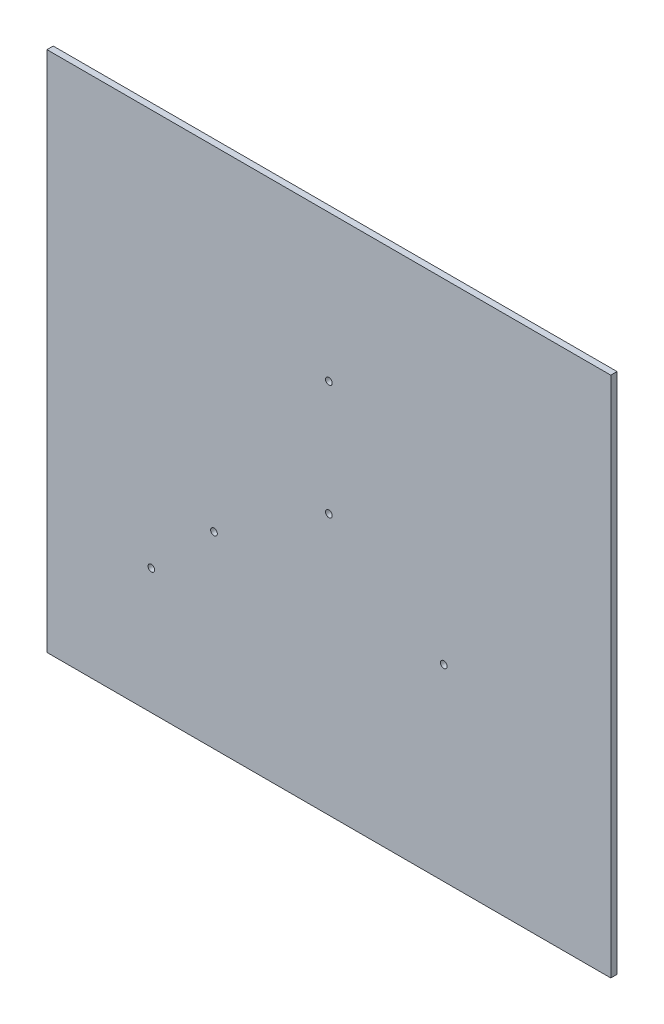
ISO-10303-21;
HEADER;
FILE_DESCRIPTION(('STEP AP214'),'2;1');
FILE_NAME('part.step','',(''),(''),'','','');
FILE_SCHEMA(('AUTOMOTIVE_DESIGN { 1 0 10303 214 1 1 1 1 }'));
ENDSEC;
DATA;
#1=APPLICATION_CONTEXT('core data for automotive mechanical design processes');
#2=APPLICATION_PROTOCOL_DEFINITION('international standard','automotive_design',2000,#1);
#3=PRODUCT_CONTEXT('',#1,'mechanical');
#4=PRODUCT('Part','Part','',(#3));
#5=PRODUCT_RELATED_PRODUCT_CATEGORY('part','',(#4));
#6=PRODUCT_DEFINITION_FORMATION('','',#4);
#7=PRODUCT_DEFINITION_CONTEXT('part definition',#1,'design');
#8=PRODUCT_DEFINITION('design','',#6,#7);
#9=PRODUCT_DEFINITION_SHAPE('','',#8);
#10=(LENGTH_UNIT() NAMED_UNIT(*) SI_UNIT(.MILLI.,.METRE.));
#11=(NAMED_UNIT(*) PLANE_ANGLE_UNIT() SI_UNIT($,.RADIAN.));
#12=(NAMED_UNIT(*) SI_UNIT($,.STERADIAN.) SOLID_ANGLE_UNIT());
#13=UNCERTAINTY_MEASURE_WITH_UNIT(LENGTH_MEASURE(1.E-05),#10,'distance_accuracy_value','');
#14=(GEOMETRIC_REPRESENTATION_CONTEXT(3) GLOBAL_UNCERTAINTY_ASSIGNED_CONTEXT((#13)) GLOBAL_UNIT_ASSIGNED_CONTEXT((#10,
#11,#12)) REPRESENTATION_CONTEXT('',''));
#15=CARTESIAN_POINT('',(0.,0.,0.));
#16=DIRECTION('',(0.,0.,1.));
#17=DIRECTION('',(1.,0.,0.));
#18=AXIS2_PLACEMENT_3D('',#15,#16,#17);
#19=CARTESIAN_POINT('',(0.,0.,3.));
#20=DIRECTION('',(0.,0.,-1.));
#21=DIRECTION('',(-1.,0.,0.));
#22=AXIS2_PLACEMENT_3D('',#19,#20,#21);
#23=PLANE('',#22);
#24=DIRECTION('',(0.,1.,0.));
#25=VECTOR('',#24,1.);
#26=CARTESIAN_POINT('',(135.,-125.,3.));
#27=LINE('',#26,#25);
#28=CARTESIAN_POINT('',(135.,-125.,3.));
#29=VERTEX_POINT('',#28);
#30=CARTESIAN_POINT('',(135.,125.,3.));
#31=VERTEX_POINT('',#30);
#32=EDGE_CURVE('E81',#29,#31,#27,.T.);
#33=ORIENTED_EDGE('',*,*,#32,.T.);
#34=DIRECTION('',(-1.,0.,0.));
#35=VECTOR('',#34,1.);
#36=CARTESIAN_POINT('',(-135.,125.,3.));
#37=LINE('',#36,#35);
#38=CARTESIAN_POINT('',(-135.,125.,3.));
#39=VERTEX_POINT('',#38);
#40=EDGE_CURVE('E76',#31,#39,#37,.T.);
#41=ORIENTED_EDGE('',*,*,#40,.T.);
#42=DIRECTION('',(0.,-1.,0.));
#43=VECTOR('',#42,1.);
#44=CARTESIAN_POINT('',(-135.,-125.,3.));
#45=LINE('',#44,#43);
#46=CARTESIAN_POINT('',(-135.,-125.,3.));
#47=VERTEX_POINT('',#46);
#48=EDGE_CURVE('E79',#39,#47,#45,.T.);
#49=ORIENTED_EDGE('',*,*,#48,.T.);
#50=DIRECTION('',(1.,0.,0.));
#51=VECTOR('',#50,1.);
#52=CARTESIAN_POINT('',(-135.,-125.,3.));
#53=LINE('',#52,#51);
#54=EDGE_CURVE('E46',#47,#29,#53,.T.);
#55=ORIENTED_EDGE('',*,*,#54,.T.);
#56=EDGE_LOOP('',(#33,#41,#49,#55));
#57=FACE_BOUND('',#56,.T.);
#58=CARTESIAN_POINT('',(-85.0000000000001,-65.,3.));
#59=DIRECTION('',(0.,0.,1.));
#60=DIRECTION('',(1.,0.,0.));
#61=AXIS2_PLACEMENT_3D('',#58,#59,#60);
#62=CIRCLE('',#61,1.60000000000001);
#63=CARTESIAN_POINT('',(-83.4000000000001,-65.,3.));
#64=VERTEX_POINT('',#63);
#65=EDGE_CURVE('E96',#64,#64,#62,.T.);
#66=ORIENTED_EDGE('',*,*,#65,.F.);
#67=EDGE_LOOP('',(#66));
#68=FACE_BOUND('',#67,.T.);
#69=CARTESIAN_POINT('',(0.,55.,3.));
#70=DIRECTION('',(0.,0.,1.));
#71=DIRECTION('',(1.,0.,0.));
#72=AXIS2_PLACEMENT_3D('',#69,#70,#71);
#73=CIRCLE('',#72,1.6);
#74=CARTESIAN_POINT('',(1.6,55.,3.));
#75=VERTEX_POINT('',#74);
#76=EDGE_CURVE('E111',#75,#75,#73,.T.);
#77=ORIENTED_EDGE('',*,*,#76,.F.);
#78=EDGE_LOOP('',(#77));
#79=FACE_BOUND('',#78,.T.);
#80=CARTESIAN_POINT('',(-55.0000000000001,-35.,3.));
#81=DIRECTION('',(0.,0.,1.));
#82=DIRECTION('',(1.,0.,0.));
#83=AXIS2_PLACEMENT_3D('',#80,#81,#82);
#84=CIRCLE('',#83,1.60000000000001);
#85=CARTESIAN_POINT('',(-53.4000000000001,-35.,3.));
#86=VERTEX_POINT('',#85);
#87=EDGE_CURVE('E117',#86,#86,#84,.T.);
#88=ORIENTED_EDGE('',*,*,#87,.F.);
#89=EDGE_LOOP('',(#88));
#90=FACE_BOUND('',#89,.T.);
#91=CARTESIAN_POINT('',(55.0000000000001,-35.,3.));
#92=DIRECTION('',(0.,0.,1.));
#93=DIRECTION('',(1.,0.,0.));
#94=AXIS2_PLACEMENT_3D('',#91,#92,#93);
#95=CIRCLE('',#94,1.60000000000001);
#96=CARTESIAN_POINT('',(56.6000000000001,-35.,3.));
#97=VERTEX_POINT('',#96);
#98=EDGE_CURVE('E123',#97,#97,#95,.T.);
#99=ORIENTED_EDGE('',*,*,#98,.F.);
#100=EDGE_LOOP('',(#99));
#101=FACE_BOUND('',#100,.T.);
#102=CARTESIAN_POINT('',(-1.38777878078145E-13,0.,3.));
#103=DIRECTION('',(0.,0.,1.));
#104=DIRECTION('',(1.,0.,0.));
#105=AXIS2_PLACEMENT_3D('',#102,#103,#104);
#106=CIRCLE('',#105,1.6);
#107=CARTESIAN_POINT('',(1.59999999999986,0.,3.));
#108=VERTEX_POINT('',#107);
#109=EDGE_CURVE('E129',#108,#108,#106,.T.);
#110=ORIENTED_EDGE('',*,*,#109,.F.);
#111=EDGE_LOOP('',(#110));
#112=FACE_BOUND('',#111,.T.);
#113=ADVANCED_FACE('F29',(#57,#68,#79,#90,#101,#112),#23,.F.);
#114=CARTESIAN_POINT('',(0.,0.,0.));
#115=DIRECTION('',(0.,0.,-1.));
#116=DIRECTION('',(-1.,0.,0.));
#117=AXIS2_PLACEMENT_3D('',#114,#115,#116);
#118=PLANE('',#117);
#119=CARTESIAN_POINT('',(55.0000000000001,-35.,0.));
#120=DIRECTION('',(0.,0.,1.));
#121=DIRECTION('',(1.,0.,0.));
#122=AXIS2_PLACEMENT_3D('',#119,#120,#121);
#123=CIRCLE('',#122,1.60000000000001);
#124=CARTESIAN_POINT('',(56.6000000000001,-35.,0.));
#125=VERTEX_POINT('',#124);
#126=EDGE_CURVE('E126',#125,#125,#123,.T.);
#127=ORIENTED_EDGE('',*,*,#126,.T.);
#128=EDGE_LOOP('',(#127));
#129=FACE_BOUND('',#128,.T.);
#130=CARTESIAN_POINT('',(0.,55.,0.));
#131=DIRECTION('',(0.,0.,1.));
#132=DIRECTION('',(1.,0.,0.));
#133=AXIS2_PLACEMENT_3D('',#130,#131,#132);
#134=CIRCLE('',#133,1.6);
#135=CARTESIAN_POINT('',(1.6,55.,0.));
#136=VERTEX_POINT('',#135);
#137=EDGE_CURVE('E114',#136,#136,#134,.T.);
#138=ORIENTED_EDGE('',*,*,#137,.T.);
#139=EDGE_LOOP('',(#138));
#140=FACE_BOUND('',#139,.T.);
#141=DIRECTION('',(0.,1.,0.));
#142=VECTOR('',#141,1.);
#143=CARTESIAN_POINT('',(135.,-125.,0.));
#144=LINE('',#143,#142);
#145=CARTESIAN_POINT('',(135.,-125.,0.));
#146=VERTEX_POINT('',#145);
#147=CARTESIAN_POINT('',(135.,125.,0.));
#148=VERTEX_POINT('',#147);
#149=EDGE_CURVE('E93',#146,#148,#144,.T.);
#150=ORIENTED_EDGE('',*,*,#149,.F.);
#151=DIRECTION('',(1.,0.,0.));
#152=VECTOR('',#151,1.);
#153=CARTESIAN_POINT('',(-135.,-125.,0.));
#154=LINE('',#153,#152);
#155=CARTESIAN_POINT('',(-135.,-125.,0.));
#156=VERTEX_POINT('',#155);
#157=EDGE_CURVE('E69',#156,#146,#154,.T.);
#158=ORIENTED_EDGE('',*,*,#157,.F.);
#159=DIRECTION('',(0.,-1.,0.));
#160=VECTOR('',#159,1.);
#161=CARTESIAN_POINT('',(-135.,-125.,0.));
#162=LINE('',#161,#160);
#163=CARTESIAN_POINT('',(-135.,125.,0.));
#164=VERTEX_POINT('',#163);
#165=EDGE_CURVE('E63',#164,#156,#162,.T.);
#166=ORIENTED_EDGE('',*,*,#165,.F.);
#167=DIRECTION('',(-1.,0.,0.));
#168=VECTOR('',#167,1.);
#169=CARTESIAN_POINT('',(-135.,125.,0.));
#170=LINE('',#169,#168);
#171=EDGE_CURVE('E85',#148,#164,#170,.T.);
#172=ORIENTED_EDGE('',*,*,#171,.F.);
#173=EDGE_LOOP('',(#150,#158,#166,#172));
#174=FACE_BOUND('',#173,.T.);
#175=CARTESIAN_POINT('',(-85.0000000000001,-65.,0.));
#176=DIRECTION('',(0.,0.,1.));
#177=DIRECTION('',(1.,0.,0.));
#178=AXIS2_PLACEMENT_3D('',#175,#176,#177);
#179=CIRCLE('',#178,1.60000000000001);
#180=CARTESIAN_POINT('',(-83.4000000000001,-65.,0.));
#181=VERTEX_POINT('',#180);
#182=EDGE_CURVE('E108',#181,#181,#179,.T.);
#183=ORIENTED_EDGE('',*,*,#182,.T.);
#184=EDGE_LOOP('',(#183));
#185=FACE_BOUND('',#184,.T.);
#186=CARTESIAN_POINT('',(-55.0000000000001,-35.,0.));
#187=DIRECTION('',(0.,0.,1.));
#188=DIRECTION('',(1.,0.,0.));
#189=AXIS2_PLACEMENT_3D('',#186,#187,#188);
#190=CIRCLE('',#189,1.60000000000001);
#191=CARTESIAN_POINT('',(-53.4000000000001,-35.,0.));
#192=VERTEX_POINT('',#191);
#193=EDGE_CURVE('E120',#192,#192,#190,.T.);
#194=ORIENTED_EDGE('',*,*,#193,.T.);
#195=EDGE_LOOP('',(#194));
#196=FACE_BOUND('',#195,.T.);
#197=CARTESIAN_POINT('',(-1.38777878078145E-13,0.,0.));
#198=DIRECTION('',(0.,0.,1.));
#199=DIRECTION('',(1.,0.,0.));
#200=AXIS2_PLACEMENT_3D('',#197,#198,#199);
#201=CIRCLE('',#200,1.6);
#202=CARTESIAN_POINT('',(1.59999999999986,0.,0.));
#203=VERTEX_POINT('',#202);
#204=EDGE_CURVE('E132',#203,#203,#201,.T.);
#205=ORIENTED_EDGE('',*,*,#204,.T.);
#206=EDGE_LOOP('',(#205));
#207=FACE_BOUND('',#206,.T.);
#208=ADVANCED_FACE('F104',(#129,#140,#174,#185,#196,#207),#118,.T.);
#209=CARTESIAN_POINT('',(135.,-125.,3.));
#210=DIRECTION('',(-1.,0.,0.));
#211=DIRECTION('',(0.,0.,1.));
#212=AXIS2_PLACEMENT_3D('',#209,#210,#211);
#213=PLANE('',#212);
#214=ORIENTED_EDGE('',*,*,#149,.T.);
#215=DIRECTION('',(0.,0.,-1.));
#216=VECTOR('',#215,1.);
#217=CARTESIAN_POINT('',(135.,125.,3.));
#218=LINE('',#217,#216);
#219=EDGE_CURVE('E11',#31,#148,#218,.T.);
#220=ORIENTED_EDGE('',*,*,#219,.F.);
#221=ORIENTED_EDGE('',*,*,#32,.F.);
#222=DIRECTION('',(0.,0.,-1.));
#223=VECTOR('',#222,1.);
#224=CARTESIAN_POINT('',(135.,-125.,3.));
#225=LINE('',#224,#223);
#226=EDGE_CURVE('E89',#29,#146,#225,.T.);
#227=ORIENTED_EDGE('',*,*,#226,.T.);
#228=EDGE_LOOP('',(#214,#220,#221,#227));
#229=FACE_BOUND('',#228,.T.);
#230=ADVANCED_FACE('F31',(#229),#213,.F.);
#231=CARTESIAN_POINT('',(-135.,125.,3.));
#232=DIRECTION('',(0.,-1.,0.));
#233=DIRECTION('',(0.,0.,-1.));
#234=AXIS2_PLACEMENT_3D('',#231,#232,#233);
#235=PLANE('',#234);
#236=ORIENTED_EDGE('',*,*,#171,.T.);
#237=DIRECTION('',(0.,0.,-1.));
#238=VECTOR('',#237,1.);
#239=CARTESIAN_POINT('',(-135.,125.,3.));
#240=LINE('',#239,#238);
#241=EDGE_CURVE('E38',#39,#164,#240,.T.);
#242=ORIENTED_EDGE('',*,*,#241,.F.);
#243=ORIENTED_EDGE('',*,*,#40,.F.);
#244=ORIENTED_EDGE('',*,*,#219,.T.);
#245=EDGE_LOOP('',(#236,#242,#243,#244));
#246=FACE_BOUND('',#245,.T.);
#247=ADVANCED_FACE('F84',(#246),#235,.F.);
#248=CARTESIAN_POINT('',(-135.,-125.,3.));
#249=DIRECTION('',(1.,0.,0.));
#250=DIRECTION('',(0.,0.,-1.));
#251=AXIS2_PLACEMENT_3D('',#248,#249,#250);
#252=PLANE('',#251);
#253=ORIENTED_EDGE('',*,*,#165,.T.);
#254=DIRECTION('',(0.,0.,-1.));
#255=VECTOR('',#254,1.);
#256=CARTESIAN_POINT('',(-135.,-125.,3.));
#257=LINE('',#256,#255);
#258=EDGE_CURVE('E86',#47,#156,#257,.T.);
#259=ORIENTED_EDGE('',*,*,#258,.F.);
#260=ORIENTED_EDGE('',*,*,#48,.F.);
#261=ORIENTED_EDGE('',*,*,#241,.T.);
#262=EDGE_LOOP('',(#253,#259,#260,#261));
#263=FACE_BOUND('',#262,.T.);
#264=ADVANCED_FACE('F87',(#263),#252,.F.);
#265=CARTESIAN_POINT('',(-135.,-125.,3.));
#266=DIRECTION('',(0.,1.,0.));
#267=DIRECTION('',(0.,0.,1.));
#268=AXIS2_PLACEMENT_3D('',#265,#266,#267);
#269=PLANE('',#268);
#270=ORIENTED_EDGE('',*,*,#157,.T.);
#271=ORIENTED_EDGE('',*,*,#226,.F.);
#272=ORIENTED_EDGE('',*,*,#54,.F.);
#273=ORIENTED_EDGE('',*,*,#258,.T.);
#274=EDGE_LOOP('',(#270,#271,#272,#273));
#275=FACE_BOUND('',#274,.T.);
#276=ADVANCED_FACE('F101',(#275),#269,.F.);
#277=CARTESIAN_POINT('',(-85.0000000000001,-65.,3.));
#278=DIRECTION('',(0.,0.,-1.));
#279=DIRECTION('',(-1.,0.,0.));
#280=AXIS2_PLACEMENT_3D('',#277,#278,#279);
#281=CYLINDRICAL_SURFACE('',#280,1.60000000000001);
#282=ORIENTED_EDGE('',*,*,#65,.T.);
#283=EDGE_LOOP('',(#282));
#284=FACE_BOUND('',#283,.T.);
#285=ORIENTED_EDGE('',*,*,#182,.F.);
#286=EDGE_LOOP('',(#285));
#287=FACE_BOUND('',#286,.T.);
#288=ADVANCED_FACE('F149',(#284,#287),#281,.F.);
#289=CARTESIAN_POINT('',(0.,55.,3.));
#290=DIRECTION('',(0.,0.,-1.));
#291=DIRECTION('',(-1.,0.,0.));
#292=AXIS2_PLACEMENT_3D('',#289,#290,#291);
#293=CYLINDRICAL_SURFACE('',#292,1.6);
#294=ORIENTED_EDGE('',*,*,#76,.T.);
#295=EDGE_LOOP('',(#294));
#296=FACE_BOUND('',#295,.T.);
#297=ORIENTED_EDGE('',*,*,#137,.F.);
#298=EDGE_LOOP('',(#297));
#299=FACE_BOUND('',#298,.T.);
#300=ADVANCED_FACE('F184',(#296,#299),#293,.F.);
#301=CARTESIAN_POINT('',(-55.0000000000001,-35.,3.));
#302=DIRECTION('',(0.,0.,-1.));
#303=DIRECTION('',(-1.,0.,0.));
#304=AXIS2_PLACEMENT_3D('',#301,#302,#303);
#305=CYLINDRICAL_SURFACE('',#304,1.60000000000001);
#306=ORIENTED_EDGE('',*,*,#87,.T.);
#307=EDGE_LOOP('',(#306));
#308=FACE_BOUND('',#307,.T.);
#309=ORIENTED_EDGE('',*,*,#193,.F.);
#310=EDGE_LOOP('',(#309));
#311=FACE_BOUND('',#310,.T.);
#312=ADVANCED_FACE('F191',(#308,#311),#305,.F.);
#313=CARTESIAN_POINT('',(55.0000000000001,-35.,3.));
#314=DIRECTION('',(0.,0.,-1.));
#315=DIRECTION('',(-1.,0.,0.));
#316=AXIS2_PLACEMENT_3D('',#313,#314,#315);
#317=CYLINDRICAL_SURFACE('',#316,1.60000000000001);
#318=ORIENTED_EDGE('',*,*,#98,.T.);
#319=EDGE_LOOP('',(#318));
#320=FACE_BOUND('',#319,.T.);
#321=ORIENTED_EDGE('',*,*,#126,.F.);
#322=EDGE_LOOP('',(#321));
#323=FACE_BOUND('',#322,.T.);
#324=ADVANCED_FACE('F198',(#320,#323),#317,.F.);
#325=CARTESIAN_POINT('',(-1.38777878078145E-13,0.,3.));
#326=DIRECTION('',(0.,0.,-1.));
#327=DIRECTION('',(-1.,0.,0.));
#328=AXIS2_PLACEMENT_3D('',#325,#326,#327);
#329=CYLINDRICAL_SURFACE('',#328,1.6);
#330=ORIENTED_EDGE('',*,*,#109,.T.);
#331=EDGE_LOOP('',(#330));
#332=FACE_BOUND('',#331,.T.);
#333=ORIENTED_EDGE('',*,*,#204,.F.);
#334=EDGE_LOOP('',(#333));
#335=FACE_BOUND('',#334,.T.);
#336=ADVANCED_FACE('F138',(#332,#335),#329,.F.);
#337=CLOSED_SHELL('',(#113,#208,#230,#247,#264,#276,#288,#300,#312,#324,#336));
#338=MANIFOLD_SOLID_BREP('B2',#337);
#339=ADVANCED_BREP_SHAPE_REPRESENTATION('',(#18,#338),#14);
#340=SHAPE_DEFINITION_REPRESENTATION(#9,#339);
ENDSEC;
END-ISO-10303-21;
